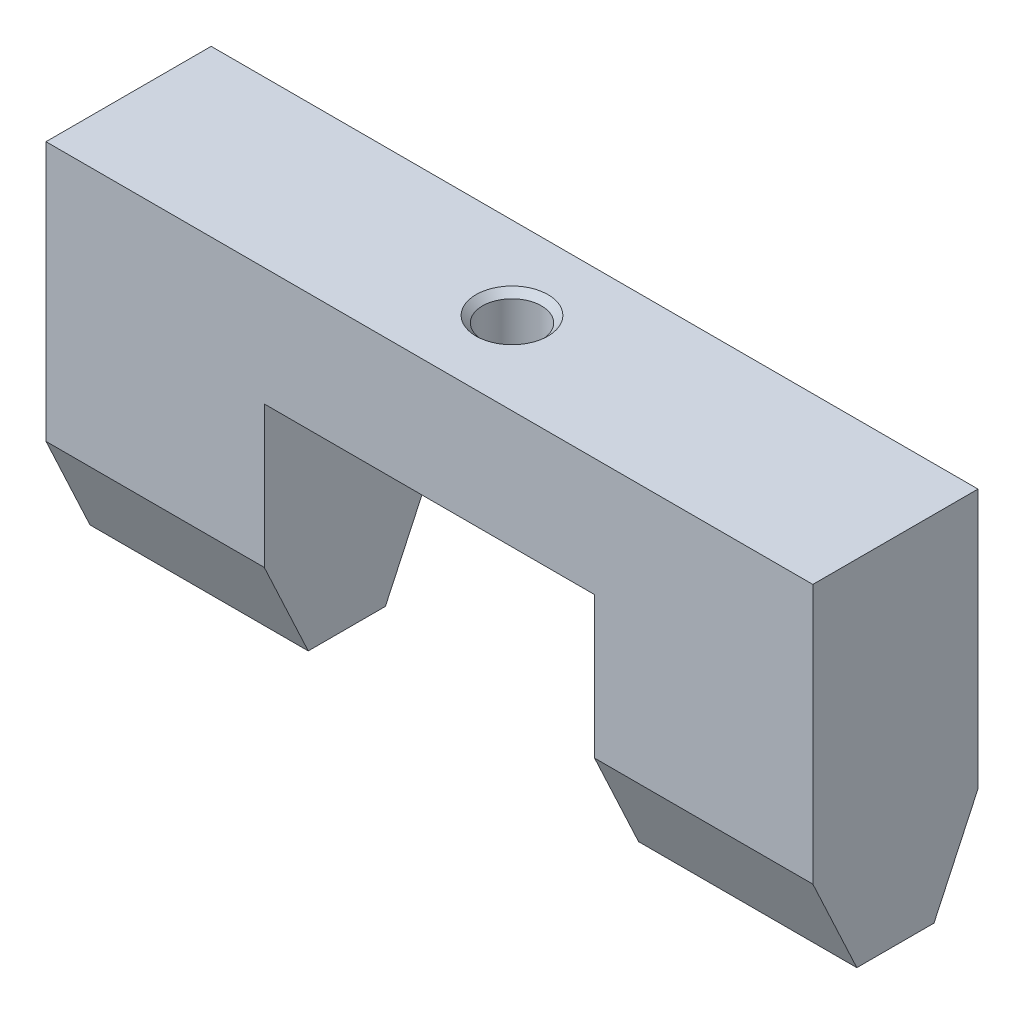
ISO-10303-21;
HEADER;
FILE_DESCRIPTION(('STEP AP214'),'2;1');
FILE_NAME('part.step','',(''),(''),'','','');
FILE_SCHEMA(('AUTOMOTIVE_DESIGN { 1 0 10303 214 1 1 1 1 }'));
ENDSEC;
DATA;
#1=APPLICATION_CONTEXT('core data for automotive mechanical design processes');
#2=APPLICATION_PROTOCOL_DEFINITION('international standard','automotive_design',2000,#1);
#3=PRODUCT_CONTEXT('',#1,'mechanical');
#4=PRODUCT('Part','Part','',(#3));
#5=PRODUCT_RELATED_PRODUCT_CATEGORY('part','',(#4));
#6=PRODUCT_DEFINITION_FORMATION('','',#4);
#7=PRODUCT_DEFINITION_CONTEXT('part definition',#1,'design');
#8=PRODUCT_DEFINITION('design','',#6,#7);
#9=PRODUCT_DEFINITION_SHAPE('','',#8);
#10=(LENGTH_UNIT() NAMED_UNIT(*) SI_UNIT(.MILLI.,.METRE.));
#11=(NAMED_UNIT(*) PLANE_ANGLE_UNIT() SI_UNIT($,.RADIAN.));
#12=(NAMED_UNIT(*) SI_UNIT($,.STERADIAN.) SOLID_ANGLE_UNIT());
#13=UNCERTAINTY_MEASURE_WITH_UNIT(LENGTH_MEASURE(1.E-05),#10,'distance_accuracy_value','');
#14=(GEOMETRIC_REPRESENTATION_CONTEXT(3) GLOBAL_UNCERTAINTY_ASSIGNED_CONTEXT((#13)) GLOBAL_UNIT_ASSIGNED_CONTEXT((#10,
#11,#12)) REPRESENTATION_CONTEXT('',''));
#15=CARTESIAN_POINT('',(0.,0.,0.));
#16=DIRECTION('',(0.,0.,1.));
#17=DIRECTION('',(1.,0.,0.));
#18=AXIS2_PLACEMENT_3D('',#15,#16,#17);
#19=CARTESIAN_POINT('',(10.25,4.00000000000001,-52.5));
#20=DIRECTION('',(0.,-1.,0.));
#21=DIRECTION('',(0.,0.,1.));
#22=AXIS2_PLACEMENT_3D('',#19,#20,#21);
#23=PLANE('',#22);
#24=DIRECTION('',(1.,0.,0.));
#25=VECTOR('',#24,1.);
#26=CARTESIAN_POINT('',(-16.25,4.,1.63476936738004));
#27=LINE('',#26,#25);
#28=CARTESIAN_POINT('',(-16.25,4.,1.63476936738004));
#29=VERTEX_POINT('',#28);
#30=CARTESIAN_POINT('',(-7.,4.,1.63476936738004));
#31=VERTEX_POINT('',#30);
#32=EDGE_CURVE('E62',#29,#31,#27,.T.);
#33=ORIENTED_EDGE('',*,*,#32,.F.);
#34=DIRECTION('',(0.,0.,-1.));
#35=VECTOR('',#34,1.);
#36=CARTESIAN_POINT('',(-16.25,4.,3.50000000000001));
#37=LINE('',#36,#35);
#38=CARTESIAN_POINT('',(-16.25,4.,-1.63476936738004));
#39=VERTEX_POINT('',#38);
#40=EDGE_CURVE('E146',#29,#39,#37,.T.);
#41=ORIENTED_EDGE('',*,*,#40,.T.);
#42=DIRECTION('',(1.,0.,0.));
#43=VECTOR('',#42,1.);
#44=CARTESIAN_POINT('',(-16.25,4.,-1.63476936738004));
#45=LINE('',#44,#43);
#46=CARTESIAN_POINT('',(-7.,4.,-1.63476936738004));
#47=VERTEX_POINT('',#46);
#48=EDGE_CURVE('E196',#39,#47,#45,.T.);
#49=ORIENTED_EDGE('',*,*,#48,.T.);
#50=DIRECTION('',(0.,0.,-1.));
#51=VECTOR('',#50,1.);
#52=CARTESIAN_POINT('',(-7.,4.00000000000001,-52.5));
#53=LINE('',#52,#51);
#54=EDGE_CURVE('E166',#31,#47,#53,.T.);
#55=ORIENTED_EDGE('',*,*,#54,.F.);
#56=EDGE_LOOP('',(#33,#41,#49,#55));
#57=FACE_BOUND('',#56,.T.);
#58=ADVANCED_FACE('F38',(#57),#23,.T.);
#59=CARTESIAN_POINT('',(-16.25,-33.2453004197586,3.5));
#60=DIRECTION('',(1.,0.,0.));
#61=DIRECTION('',(0.,0.,-1.));
#62=AXIS2_PLACEMENT_3D('',#59,#60,#61);
#63=PLANE('',#62);
#64=ORIENTED_EDGE('',*,*,#40,.F.);
#65=DIRECTION('',(0.,0.906307787036652,0.422618261740694));
#66=VECTOR('',#65,1.);
#67=CARTESIAN_POINT('',(-16.25,4.,1.63476936738004));
#68=LINE('',#67,#66);
#69=CARTESIAN_POINT('',(-16.25,8.,3.5));
#70=VERTEX_POINT('',#69);
#71=EDGE_CURVE('E129',#29,#70,#68,.T.);
#72=ORIENTED_EDGE('',*,*,#71,.T.);
#73=DIRECTION('',(0.,1.,0.));
#74=VECTOR('',#73,1.);
#75=CARTESIAN_POINT('',(-16.25,-33.2453004197586,3.5));
#76=LINE('',#75,#74);
#77=CARTESIAN_POINT('',(-16.25,19.,3.5));
#78=VERTEX_POINT('',#77);
#79=EDGE_CURVE('E142',#70,#78,#76,.T.);
#80=ORIENTED_EDGE('',*,*,#79,.T.);
#81=DIRECTION('',(0.,0.,-1.));
#82=VECTOR('',#81,1.);
#83=CARTESIAN_POINT('',(-16.25,19.,3.5));
#84=LINE('',#83,#82);
#85=CARTESIAN_POINT('',(-16.25,19.,-3.5));
#86=VERTEX_POINT('',#85);
#87=EDGE_CURVE('E154',#78,#86,#84,.T.);
#88=ORIENTED_EDGE('',*,*,#87,.T.);
#89=DIRECTION('',(0.,1.,0.));
#90=VECTOR('',#89,1.);
#91=CARTESIAN_POINT('',(-16.25,-33.2453004197586,-3.5));
#92=LINE('',#91,#90);
#93=CARTESIAN_POINT('',(-16.25,8.,-3.5));
#94=VERTEX_POINT('',#93);
#95=EDGE_CURVE('E153',#94,#86,#92,.T.);
#96=ORIENTED_EDGE('',*,*,#95,.F.);
#97=DIRECTION('',(0.,-0.906307787036653,0.422618261740693));
#98=VECTOR('',#97,1.);
#99=CARTESIAN_POINT('',(-16.25,4.,-1.63476936738004));
#100=LINE('',#99,#98);
#101=EDGE_CURVE('E191',#94,#39,#100,.T.);
#102=ORIENTED_EDGE('',*,*,#101,.T.);
#103=EDGE_LOOP('',(#64,#72,#80,#88,#96,#102));
#104=FACE_BOUND('',#103,.T.);
#105=ADVANCED_FACE('F140',(#104),#63,.F.);
#106=CARTESIAN_POINT('',(-16.25,-33.2453004197586,-3.5));
#107=DIRECTION('',(0.,0.,1.));
#108=DIRECTION('',(0.,-1.,0.));
#109=AXIS2_PLACEMENT_3D('',#106,#107,#108);
#110=PLANE('',#109);
#111=DIRECTION('',(0.,1.,0.));
#112=VECTOR('',#111,1.);
#113=CARTESIAN_POINT('',(16.25,-33.2453004197586,-3.5));
#114=LINE('',#113,#112);
#115=CARTESIAN_POINT('',(16.25,8.,-3.5));
#116=VERTEX_POINT('',#115);
#117=CARTESIAN_POINT('',(16.25,19.,-3.5));
#118=VERTEX_POINT('',#117);
#119=EDGE_CURVE('E156',#116,#118,#114,.T.);
#120=ORIENTED_EDGE('',*,*,#119,.F.);
#121=DIRECTION('',(1.,0.,0.));
#122=VECTOR('',#121,1.);
#123=CARTESIAN_POINT('',(-16.25,8.,-3.5));
#124=LINE('',#123,#122);
#125=CARTESIAN_POINT('',(7.,8.,-3.5));
#126=VERTEX_POINT('',#125);
#127=EDGE_CURVE('E193',#126,#116,#124,.T.);
#128=ORIENTED_EDGE('',*,*,#127,.F.);
#129=DIRECTION('',(0.,1.,0.));
#130=VECTOR('',#129,1.);
#131=CARTESIAN_POINT('',(7.,-33.2453004197586,-3.5));
#132=LINE('',#131,#130);
#133=CARTESIAN_POINT('',(7.,14.,-3.5));
#134=VERTEX_POINT('',#133);
#135=EDGE_CURVE('E176',#126,#134,#132,.T.);
#136=ORIENTED_EDGE('',*,*,#135,.T.);
#137=DIRECTION('',(-1.,0.,0.));
#138=VECTOR('',#137,1.);
#139=CARTESIAN_POINT('',(-16.25,14.,-3.5));
#140=LINE('',#139,#138);
#141=CARTESIAN_POINT('',(-7.,14.,-3.5));
#142=VERTEX_POINT('',#141);
#143=EDGE_CURVE('E218',#134,#142,#140,.T.);
#144=ORIENTED_EDGE('',*,*,#143,.T.);
#145=DIRECTION('',(0.,-1.,0.));
#146=VECTOR('',#145,1.);
#147=CARTESIAN_POINT('',(-7.,-33.2453004197586,-3.5));
#148=LINE('',#147,#146);
#149=CARTESIAN_POINT('',(-7.,8.,-3.5));
#150=VERTEX_POINT('',#149);
#151=EDGE_CURVE('E215',#142,#150,#148,.T.);
#152=ORIENTED_EDGE('',*,*,#151,.T.);
#153=EDGE_CURVE('E54',#94,#150,#124,.T.);
#154=ORIENTED_EDGE('',*,*,#153,.F.);
#155=ORIENTED_EDGE('',*,*,#95,.T.);
#156=DIRECTION('',(1.,0.,0.));
#157=VECTOR('',#156,1.);
#158=CARTESIAN_POINT('',(-16.25,19.,-3.5));
#159=LINE('',#158,#157);
#160=EDGE_CURVE('E221',#86,#118,#159,.T.);
#161=ORIENTED_EDGE('',*,*,#160,.T.);
#162=EDGE_LOOP('',(#120,#128,#136,#144,#152,#154,#155,#161));
#163=FACE_BOUND('',#162,.T.);
#164=ADVANCED_FACE('F241',(#163),#110,.F.);
#165=CARTESIAN_POINT('',(16.25,-33.2453004197586,3.5));
#166=DIRECTION('',(-1.,0.,0.));
#167=DIRECTION('',(0.,0.,1.));
#168=AXIS2_PLACEMENT_3D('',#165,#166,#167);
#169=PLANE('',#168);
#170=DIRECTION('',(0.,1.,0.));
#171=VECTOR('',#170,1.);
#172=CARTESIAN_POINT('',(16.25,-33.2453004197586,3.5));
#173=LINE('',#172,#171);
#174=CARTESIAN_POINT('',(16.25,8.,3.5));
#175=VERTEX_POINT('',#174);
#176=CARTESIAN_POINT('',(16.25,19.,3.5));
#177=VERTEX_POINT('',#176);
#178=EDGE_CURVE('E161',#175,#177,#173,.T.);
#179=ORIENTED_EDGE('',*,*,#178,.F.);
#180=DIRECTION('',(0.,0.906307787036652,0.422618261740694));
#181=VECTOR('',#180,1.);
#182=CARTESIAN_POINT('',(16.25,4.,1.63476936738004));
#183=LINE('',#182,#181);
#184=CARTESIAN_POINT('',(16.25,4.,1.63476936738004));
#185=VERTEX_POINT('',#184);
#186=EDGE_CURVE('E147',#185,#175,#183,.T.);
#187=ORIENTED_EDGE('',*,*,#186,.F.);
#188=DIRECTION('',(0.,0.,1.));
#189=VECTOR('',#188,1.);
#190=CARTESIAN_POINT('',(16.25,4.,3.50000000000001));
#191=LINE('',#190,#189);
#192=CARTESIAN_POINT('',(16.25,4.,-1.63476936738004));
#193=VERTEX_POINT('',#192);
#194=EDGE_CURVE('E167',#193,#185,#191,.T.);
#195=ORIENTED_EDGE('',*,*,#194,.F.);
#196=DIRECTION('',(0.,-0.906307787036653,0.422618261740693));
#197=VECTOR('',#196,1.);
#198=CARTESIAN_POINT('',(16.25,4.,-1.63476936738004));
#199=LINE('',#198,#197);
#200=EDGE_CURVE('E194',#116,#193,#199,.T.);
#201=ORIENTED_EDGE('',*,*,#200,.F.);
#202=ORIENTED_EDGE('',*,*,#119,.T.);
#203=DIRECTION('',(0.,0.,1.));
#204=VECTOR('',#203,1.);
#205=CARTESIAN_POINT('',(16.25,19.,3.5));
#206=LINE('',#205,#204);
#207=EDGE_CURVE('E223',#118,#177,#206,.T.);
#208=ORIENTED_EDGE('',*,*,#207,.T.);
#209=EDGE_LOOP('',(#179,#187,#195,#201,#202,#208));
#210=FACE_BOUND('',#209,.T.);
#211=ADVANCED_FACE('F239',(#210),#169,.F.);
#212=CARTESIAN_POINT('',(-16.25,-33.2453004197586,3.5));
#213=DIRECTION('',(0.,0.,-1.));
#214=DIRECTION('',(0.,1.,0.));
#215=AXIS2_PLACEMENT_3D('',#212,#213,#214);
#216=PLANE('',#215);
#217=ORIENTED_EDGE('',*,*,#79,.F.);
#218=DIRECTION('',(1.,0.,0.));
#219=VECTOR('',#218,1.);
#220=CARTESIAN_POINT('',(-16.25,8.,3.5));
#221=LINE('',#220,#219);
#222=CARTESIAN_POINT('',(-7.,8.,3.5));
#223=VERTEX_POINT('',#222);
#224=EDGE_CURVE('E126',#70,#223,#221,.T.);
#225=ORIENTED_EDGE('',*,*,#224,.T.);
#226=DIRECTION('',(0.,-1.,0.));
#227=VECTOR('',#226,1.);
#228=CARTESIAN_POINT('',(-7.,4.,3.5));
#229=LINE('',#228,#227);
#230=CARTESIAN_POINT('',(-7.,14.,3.5));
#231=VERTEX_POINT('',#230);
#232=EDGE_CURVE('E202',#231,#223,#229,.T.);
#233=ORIENTED_EDGE('',*,*,#232,.F.);
#234=DIRECTION('',(-1.,0.,0.));
#235=VECTOR('',#234,1.);
#236=CARTESIAN_POINT('',(-7.,14.,3.5));
#237=LINE('',#236,#235);
#238=CARTESIAN_POINT('',(7.,14.,3.5));
#239=VERTEX_POINT('',#238);
#240=EDGE_CURVE('E206',#239,#231,#237,.T.);
#241=ORIENTED_EDGE('',*,*,#240,.F.);
#242=DIRECTION('',(0.,1.,0.));
#243=VECTOR('',#242,1.);
#244=CARTESIAN_POINT('',(7.,4.,3.5));
#245=LINE('',#244,#243);
#246=CARTESIAN_POINT('',(7.,8.,3.5));
#247=VERTEX_POINT('',#246);
#248=EDGE_CURVE('E204',#247,#239,#245,.T.);
#249=ORIENTED_EDGE('',*,*,#248,.F.);
#250=EDGE_CURVE('E136',#247,#175,#221,.T.);
#251=ORIENTED_EDGE('',*,*,#250,.T.);
#252=ORIENTED_EDGE('',*,*,#178,.T.);
#253=DIRECTION('',(-1.,0.,0.));
#254=VECTOR('',#253,1.);
#255=CARTESIAN_POINT('',(-16.25,19.,3.5));
#256=LINE('',#255,#254);
#257=EDGE_CURVE('E152',#177,#78,#256,.T.);
#258=ORIENTED_EDGE('',*,*,#257,.T.);
#259=EDGE_LOOP('',(#217,#225,#233,#241,#249,#251,#252,#258));
#260=FACE_BOUND('',#259,.T.);
#261=ADVANCED_FACE('F150',(#260),#216,.F.);
#262=CARTESIAN_POINT('',(7.,4.,1.63476936738004));
#263=VERTEX_POINT('',#262);
#264=EDGE_CURVE('E135',#263,#185,#27,.T.);
#265=ORIENTED_EDGE('',*,*,#264,.F.);
#266=DIRECTION('',(0.,0.,1.));
#267=VECTOR('',#266,1.);
#268=CARTESIAN_POINT('',(7.,4.00000000000001,-52.5));
#269=LINE('',#268,#267);
#270=CARTESIAN_POINT('',(7.,4.,-1.63476936738003));
#271=VERTEX_POINT('',#270);
#272=EDGE_CURVE('E163',#271,#263,#269,.T.);
#273=ORIENTED_EDGE('',*,*,#272,.F.);
#274=EDGE_CURVE('E183',#271,#193,#45,.T.);
#275=ORIENTED_EDGE('',*,*,#274,.T.);
#276=ORIENTED_EDGE('',*,*,#194,.T.);
#277=EDGE_LOOP('',(#265,#273,#275,#276));
#278=FACE_BOUND('',#277,.T.);
#279=ADVANCED_FACE('F40',(#278),#23,.T.);
#280=CARTESIAN_POINT('',(-10.1,19.,107.));
#281=DIRECTION('',(0.,1.,0.));
#282=DIRECTION('',(0.,0.,1.));
#283=AXIS2_PLACEMENT_3D('',#280,#281,#282);
#284=PLANE('',#283);
#285=CARTESIAN_POINT('',(0.,19.,0.));
#286=DIRECTION('',(0.,1.,0.));
#287=DIRECTION('',(0.,0.,1.));
#288=AXIS2_PLACEMENT_3D('',#285,#286,#287);
#289=CIRCLE('',#288,1.525);
#290=CARTESIAN_POINT('',(0.,19.,1.525));
#291=VERTEX_POINT('',#290);
#292=EDGE_CURVE('E296',#291,#291,#289,.T.);
#293=ORIENTED_EDGE('',*,*,#292,.F.);
#294=EDGE_LOOP('',(#293));
#295=FACE_BOUND('',#294,.T.);
#296=ORIENTED_EDGE('',*,*,#87,.F.);
#297=ORIENTED_EDGE('',*,*,#257,.F.);
#298=ORIENTED_EDGE('',*,*,#207,.F.);
#299=ORIENTED_EDGE('',*,*,#160,.F.);
#300=EDGE_LOOP('',(#296,#297,#298,#299));
#301=FACE_BOUND('',#300,.T.);
#302=ADVANCED_FACE('F237',(#295,#301),#284,.T.);
#303=CARTESIAN_POINT('',(-7.,14.,-107.));
#304=DIRECTION('',(0.,1.,0.));
#305=DIRECTION('',(0.,0.,1.));
#306=AXIS2_PLACEMENT_3D('',#303,#304,#305);
#307=PLANE('',#306);
#308=CARTESIAN_POINT('',(0.,14.,0.));
#309=DIRECTION('',(0.,1.,0.));
#310=DIRECTION('',(0.,0.,1.));
#311=AXIS2_PLACEMENT_3D('',#308,#309,#310);
#312=CIRCLE('',#311,1.24999999999999);
#313=CARTESIAN_POINT('',(0.,14.,1.24999999999999));
#314=VERTEX_POINT('',#313);
#315=EDGE_CURVE('E42',#314,#314,#312,.T.);
#316=ORIENTED_EDGE('',*,*,#315,.T.);
#317=EDGE_LOOP('',(#316));
#318=FACE_BOUND('',#317,.T.);
#319=DIRECTION('',(0.,0.,1.));
#320=VECTOR('',#319,1.);
#321=CARTESIAN_POINT('',(7.,14.,-107.));
#322=LINE('',#321,#320);
#323=EDGE_CURVE('E209',#134,#239,#322,.T.);
#324=ORIENTED_EDGE('',*,*,#323,.T.);
#325=ORIENTED_EDGE('',*,*,#240,.T.);
#326=DIRECTION('',(0.,0.,1.));
#327=VECTOR('',#326,1.);
#328=CARTESIAN_POINT('',(-7.,14.,-107.));
#329=LINE('',#328,#327);
#330=EDGE_CURVE('E210',#142,#231,#329,.T.);
#331=ORIENTED_EDGE('',*,*,#330,.F.);
#332=ORIENTED_EDGE('',*,*,#143,.F.);
#333=EDGE_LOOP('',(#324,#325,#331,#332));
#334=FACE_BOUND('',#333,.T.);
#335=ADVANCED_FACE('F259',(#318,#334),#307,.F.);
#336=CARTESIAN_POINT('',(-7.,4.,-107.));
#337=DIRECTION('',(-1.,0.,0.));
#338=DIRECTION('',(0.,0.,1.));
#339=AXIS2_PLACEMENT_3D('',#336,#337,#338);
#340=PLANE('',#339);
#341=ORIENTED_EDGE('',*,*,#232,.T.);
#342=DIRECTION('',(0.,-0.906307787036652,-0.422618261740694));
#343=VECTOR('',#342,1.);
#344=CARTESIAN_POINT('',(-7.,-37.6095307016962,-17.7680734510561));
#345=LINE('',#344,#343);
#346=EDGE_CURVE('E130',#223,#31,#345,.T.);
#347=ORIENTED_EDGE('',*,*,#346,.T.);
#348=ORIENTED_EDGE('',*,*,#54,.T.);
#349=DIRECTION('',(0.,0.906307787036653,-0.422618261740693));
#350=VECTOR('',#349,1.);
#351=CARTESIAN_POINT('',(-7.,44.3572247120336,-20.4536523124831));
#352=LINE('',#351,#350);
#353=EDGE_CURVE('E188',#47,#150,#352,.T.);
#354=ORIENTED_EDGE('',*,*,#353,.T.);
#355=ORIENTED_EDGE('',*,*,#151,.F.);
#356=ORIENTED_EDGE('',*,*,#330,.T.);
#357=EDGE_LOOP('',(#341,#347,#348,#354,#355,#356));
#358=FACE_BOUND('',#357,.T.);
#359=ADVANCED_FACE('F265',(#358),#340,.F.);
#360=CARTESIAN_POINT('',(7.,4.,-107.));
#361=DIRECTION('',(1.,0.,0.));
#362=DIRECTION('',(0.,0.,-1.));
#363=AXIS2_PLACEMENT_3D('',#360,#361,#362);
#364=PLANE('',#363);
#365=ORIENTED_EDGE('',*,*,#272,.T.);
#366=DIRECTION('',(0.,0.906307787036652,0.422618261740694));
#367=VECTOR('',#366,1.);
#368=CARTESIAN_POINT('',(7.,-37.6095307016962,-17.7680734510561));
#369=LINE('',#368,#367);
#370=EDGE_CURVE('E11',#263,#247,#369,.T.);
#371=ORIENTED_EDGE('',*,*,#370,.T.);
#372=ORIENTED_EDGE('',*,*,#248,.T.);
#373=ORIENTED_EDGE('',*,*,#323,.F.);
#374=ORIENTED_EDGE('',*,*,#135,.F.);
#375=DIRECTION('',(0.,-0.906307787036653,0.422618261740693));
#376=VECTOR('',#375,1.);
#377=CARTESIAN_POINT('',(7.,44.3572247120336,-20.4536523124831));
#378=LINE('',#377,#376);
#379=EDGE_CURVE('E47',#126,#271,#378,.T.);
#380=ORIENTED_EDGE('',*,*,#379,.T.);
#381=EDGE_LOOP('',(#365,#371,#372,#373,#374,#380));
#382=FACE_BOUND('',#381,.T.);
#383=ADVANCED_FACE('F174',(#382),#364,.F.);
#384=CARTESIAN_POINT('',(-16.25,4.,-1.63476936738004));
#385=DIRECTION('',(0.,0.422618261740693,0.906307787036653));
#386=DIRECTION('',(0.,-0.906307787036653,0.422618261740693));
#387=AXIS2_PLACEMENT_3D('',#384,#385,#386);
#388=PLANE('',#387);
#389=ORIENTED_EDGE('',*,*,#127,.T.);
#390=ORIENTED_EDGE('',*,*,#200,.T.);
#391=ORIENTED_EDGE('',*,*,#274,.F.);
#392=ORIENTED_EDGE('',*,*,#379,.F.);
#393=EDGE_LOOP('',(#389,#390,#391,#392));
#394=FACE_BOUND('',#393,.T.);
#395=ADVANCED_FACE('F274',(#394),#388,.F.);
#396=CARTESIAN_POINT('',(-16.25,4.,1.63476936738004));
#397=DIRECTION('',(0.,0.422618261740694,-0.906307787036652));
#398=DIRECTION('',(0.,0.906307787036652,0.422618261740694));
#399=AXIS2_PLACEMENT_3D('',#396,#397,#398);
#400=PLANE('',#399);
#401=ORIENTED_EDGE('',*,*,#264,.T.);
#402=ORIENTED_EDGE('',*,*,#186,.T.);
#403=ORIENTED_EDGE('',*,*,#250,.F.);
#404=ORIENTED_EDGE('',*,*,#370,.F.);
#405=EDGE_LOOP('',(#401,#402,#403,#404));
#406=FACE_BOUND('',#405,.T.);
#407=ADVANCED_FACE('F279',(#406),#400,.F.);
#408=ORIENTED_EDGE('',*,*,#48,.F.);
#409=ORIENTED_EDGE('',*,*,#101,.F.);
#410=ORIENTED_EDGE('',*,*,#153,.T.);
#411=ORIENTED_EDGE('',*,*,#353,.F.);
#412=EDGE_LOOP('',(#408,#409,#410,#411));
#413=FACE_BOUND('',#412,.T.);
#414=ADVANCED_FACE('F276',(#413),#388,.F.);
#415=ORIENTED_EDGE('',*,*,#224,.F.);
#416=ORIENTED_EDGE('',*,*,#71,.F.);
#417=ORIENTED_EDGE('',*,*,#32,.T.);
#418=ORIENTED_EDGE('',*,*,#346,.F.);
#419=EDGE_LOOP('',(#415,#416,#417,#418));
#420=FACE_BOUND('',#419,.T.);
#421=ADVANCED_FACE('F128',(#420),#400,.F.);
#422=CARTESIAN_POINT('',(0.,19.,0.));
#423=DIRECTION('',(0.,1.,0.));
#424=DIRECTION('',(0.,0.,1.));
#425=AXIS2_PLACEMENT_3D('',#422,#423,#424);
#426=CYLINDRICAL_SURFACE('',#425,1.24999999999999);
#427=CARTESIAN_POINT('',(0.,18.725,0.));
#428=DIRECTION('',(0.,1.,0.));
#429=DIRECTION('',(0.,0.,1.));
#430=AXIS2_PLACEMENT_3D('',#427,#428,#429);
#431=CIRCLE('',#430,1.24999999999999);
#432=CARTESIAN_POINT('',(0.,18.725,1.24999999999999));
#433=VERTEX_POINT('',#432);
#434=EDGE_CURVE('E294',#433,#433,#431,.T.);
#435=ORIENTED_EDGE('',*,*,#434,.T.);
#436=EDGE_LOOP('',(#435));
#437=FACE_BOUND('',#436,.T.);
#438=ORIENTED_EDGE('',*,*,#315,.F.);
#439=EDGE_LOOP('',(#438));
#440=FACE_BOUND('',#439,.T.);
#441=ADVANCED_FACE('F282',(#437,#440),#426,.F.);
#442=CARTESIAN_POINT('',(0.,19.,0.));
#443=DIRECTION('',(0.,1.,0.));
#444=DIRECTION('',(0.,0.,1.));
#445=AXIS2_PLACEMENT_3D('',#442,#443,#444);
#446=CONICAL_SURFACE('',#445,1.525,0.78539816339745);
#447=ORIENTED_EDGE('',*,*,#434,.F.);
#448=EDGE_LOOP('',(#447));
#449=FACE_BOUND('',#448,.T.);
#450=ORIENTED_EDGE('',*,*,#292,.T.);
#451=EDGE_LOOP('',(#450));
#452=FACE_BOUND('',#451,.T.);
#453=ADVANCED_FACE('F285',(#449,#452),#446,.F.);
#454=CLOSED_SHELL('',(#58,#105,#164,#211,#261,#279,#302,#335,#359,#383,#395,#407,#414,#421,#441,#453));
#455=MANIFOLD_SOLID_BREP('B2',#454);
#456=ADVANCED_BREP_SHAPE_REPRESENTATION('',(#18,#455),#14);
#457=SHAPE_DEFINITION_REPRESENTATION(#9,#456);
ENDSEC;
END-ISO-10303-21;
